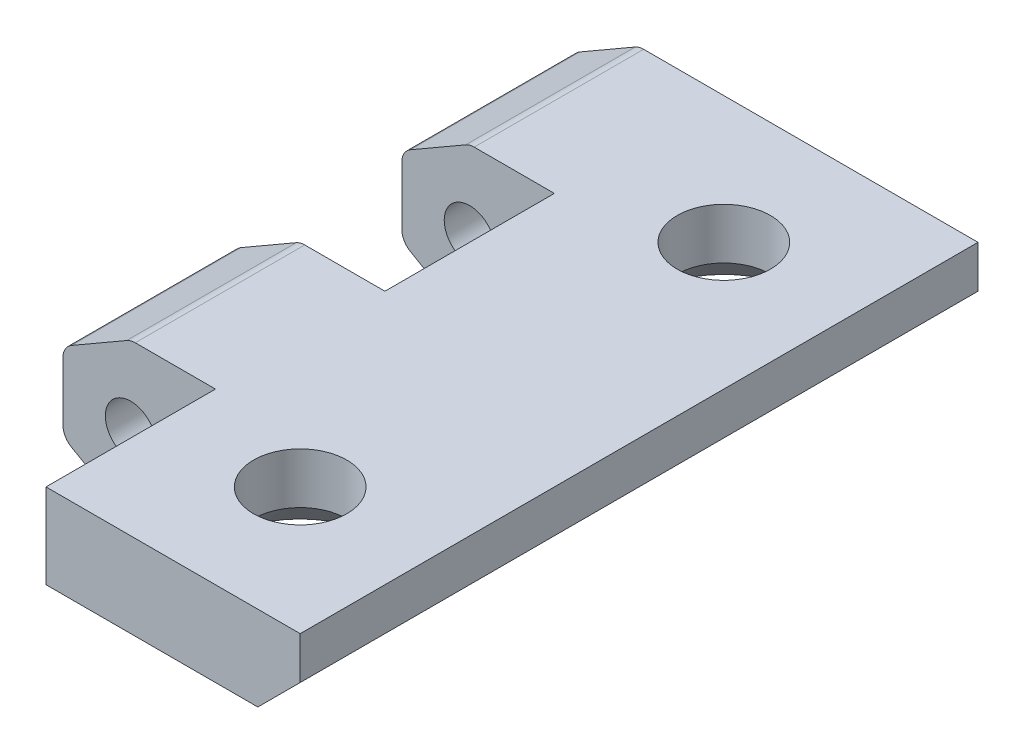
ISO-10303-21;
HEADER;
FILE_DESCRIPTION(('STEP AP214'),'2;1');
FILE_NAME('part.step','',(''),(''),'','','');
FILE_SCHEMA(('AUTOMOTIVE_DESIGN { 1 0 10303 214 1 1 1 1 }'));
ENDSEC;
DATA;
#1=APPLICATION_CONTEXT('core data for automotive mechanical design processes');
#2=APPLICATION_PROTOCOL_DEFINITION('international standard','automotive_design',2000,#1);
#3=PRODUCT_CONTEXT('',#1,'mechanical');
#4=PRODUCT('Part','Part','',(#3));
#5=PRODUCT_RELATED_PRODUCT_CATEGORY('part','',(#4));
#6=PRODUCT_DEFINITION_FORMATION('','',#4);
#7=PRODUCT_DEFINITION_CONTEXT('part definition',#1,'design');
#8=PRODUCT_DEFINITION('design','',#6,#7);
#9=PRODUCT_DEFINITION_SHAPE('','',#8);
#10=(LENGTH_UNIT() NAMED_UNIT(*) SI_UNIT(.MILLI.,.METRE.));
#11=(NAMED_UNIT(*) PLANE_ANGLE_UNIT() SI_UNIT($,.RADIAN.));
#12=(NAMED_UNIT(*) SI_UNIT($,.STERADIAN.) SOLID_ANGLE_UNIT());
#13=UNCERTAINTY_MEASURE_WITH_UNIT(LENGTH_MEASURE(1.E-05),#10,'distance_accuracy_value','');
#14=(GEOMETRIC_REPRESENTATION_CONTEXT(3) GLOBAL_UNCERTAINTY_ASSIGNED_CONTEXT((#13)) GLOBAL_UNIT_ASSIGNED_CONTEXT((#10,
#11,#12)) REPRESENTATION_CONTEXT('',''));
#15=CARTESIAN_POINT('',(0.,0.,0.));
#16=DIRECTION('',(0.,0.,1.));
#17=DIRECTION('',(1.,0.,0.));
#18=AXIS2_PLACEMENT_3D('',#15,#16,#17);
#19=CARTESIAN_POINT('',(4.,0.,40.));
#20=DIRECTION('',(-1.,0.,0.));
#21=DIRECTION('',(0.,-1.,0.));
#22=AXIS2_PLACEMENT_3D('',#19,#20,#21);
#23=PLANE('',#22);
#24=DIRECTION('',(0.,-1.,0.));
#25=VECTOR('',#24,1.);
#26=CARTESIAN_POINT('',(4.,0.,30.));
#27=LINE('',#26,#25);
#28=CARTESIAN_POINT('',(4.,-0.381197846482994,30.));
#29=VERTEX_POINT('',#28);
#30=CARTESIAN_POINT('',(4.,-1.73205080756888,30.));
#31=VERTEX_POINT('',#30);
#32=EDGE_CURVE('E317',#29,#31,#27,.T.);
#33=ORIENTED_EDGE('',*,*,#32,.T.);
#34=DIRECTION('',(0.,0.,-1.));
#35=VECTOR('',#34,1.);
#36=CARTESIAN_POINT('',(4.,-1.73205080756888,40.));
#37=LINE('',#36,#35);
#38=CARTESIAN_POINT('',(4.,-1.73205080756888,20.));
#39=VERTEX_POINT('',#38);
#40=EDGE_CURVE('E44',#31,#39,#37,.T.);
#41=ORIENTED_EDGE('',*,*,#40,.T.);
#42=DIRECTION('',(0.,1.,0.));
#43=VECTOR('',#42,1.);
#44=CARTESIAN_POINT('',(4.,0.,20.));
#45=LINE('',#44,#43);
#46=CARTESIAN_POINT('',(4.,-0.381197846482994,20.));
#47=VERTEX_POINT('',#46);
#48=EDGE_CURVE('E299',#39,#47,#45,.T.);
#49=ORIENTED_EDGE('',*,*,#48,.T.);
#50=DIRECTION('',(0.,0.,-1.));
#51=VECTOR('',#50,1.);
#52=CARTESIAN_POINT('',(4.,-0.381197846482994,40.));
#53=LINE('',#52,#51);
#54=EDGE_CURVE('E373',#29,#47,#53,.T.);
#55=ORIENTED_EDGE('',*,*,#54,.F.);
#56=EDGE_LOOP('',(#33,#41,#49,#55));
#57=FACE_BOUND('',#56,.T.);
#58=ADVANCED_FACE('F36',(#57),#23,.F.);
#59=CARTESIAN_POINT('',(-2.,3.46410161513776,40.));
#60=DIRECTION('',(0.5,-0.866025403784439,0.));
#61=DIRECTION('',(0.866025403784439,0.5,0.));
#62=AXIS2_PLACEMENT_3D('',#59,#60,#61);
#63=PLANE('',#62);
#64=DIRECTION('',(0.866025403784439,0.5,0.));
#65=VECTOR('',#64,1.);
#66=CARTESIAN_POINT('',(-2.,3.46410161513776,30.));
#67=LINE('',#66,#65);
#68=CARTESIAN_POINT('',(-3.5,2.59807621135332,30.));
#69=VERTEX_POINT('',#68);
#70=CARTESIAN_POINT('',(-0.232050807568877,4.48482755730145,30.));
#71=VERTEX_POINT('',#70);
#72=EDGE_CURVE('E314',#69,#71,#67,.T.);
#73=ORIENTED_EDGE('',*,*,#72,.T.);
#74=DIRECTION('',(0.,0.,-1.));
#75=VECTOR('',#74,1.);
#76=CARTESIAN_POINT('',(-0.232050807568877,4.48482755730145,20.));
#77=LINE('',#76,#75);
#78=CARTESIAN_POINT('',(-0.232050807568877,4.48482755730145,20.));
#79=VERTEX_POINT('',#78);
#80=EDGE_CURVE('E399',#71,#79,#77,.T.);
#81=ORIENTED_EDGE('',*,*,#80,.T.);
#82=DIRECTION('',(-0.866025403784439,-0.5,0.));
#83=VECTOR('',#82,1.);
#84=CARTESIAN_POINT('',(-2.,3.46410161513775,20.));
#85=LINE('',#84,#83);
#86=CARTESIAN_POINT('',(-3.5,2.59807621135332,20.));
#87=VERTEX_POINT('',#86);
#88=EDGE_CURVE('E296',#79,#87,#85,.T.);
#89=ORIENTED_EDGE('',*,*,#88,.T.);
#90=DIRECTION('',(0.,0.,-1.));
#91=VECTOR('',#90,1.);
#92=CARTESIAN_POINT('',(-3.5,2.59807621135332,40.));
#93=LINE('',#92,#91);
#94=EDGE_CURVE('E391',#87,#69,#93,.F.);
#95=ORIENTED_EDGE('',*,*,#94,.T.);
#96=EDGE_LOOP('',(#73,#81,#89,#95));
#97=FACE_BOUND('',#96,.T.);
#98=ADVANCED_FACE('F561',(#97),#63,.F.);
#99=CARTESIAN_POINT('',(-4.,0.,40.));
#100=DIRECTION('',(1.,0.,0.));
#101=DIRECTION('',(0.,0.,-1.));
#102=AXIS2_PLACEMENT_3D('',#99,#100,#101);
#103=PLANE('',#102);
#104=DIRECTION('',(0.,1.,0.));
#105=VECTOR('',#104,1.);
#106=CARTESIAN_POINT('',(-4.,0.,30.));
#107=LINE('',#106,#105);
#108=CARTESIAN_POINT('',(-4.,-1.73205080756888,30.));
#109=VERTEX_POINT('',#108);
#110=CARTESIAN_POINT('',(-4.,1.73205080756888,30.));
#111=VERTEX_POINT('',#110);
#112=EDGE_CURVE('E311',#109,#111,#107,.T.);
#113=ORIENTED_EDGE('',*,*,#112,.T.);
#114=DIRECTION('',(0.,0.,-1.));
#115=VECTOR('',#114,1.);
#116=CARTESIAN_POINT('',(-4.,1.73205080756888,40.));
#117=LINE('',#116,#115);
#118=CARTESIAN_POINT('',(-4.,1.73205080756888,20.));
#119=VERTEX_POINT('',#118);
#120=EDGE_CURVE('E450',#111,#119,#117,.T.);
#121=ORIENTED_EDGE('',*,*,#120,.T.);
#122=DIRECTION('',(0.,-1.,0.));
#123=VECTOR('',#122,1.);
#124=CARTESIAN_POINT('',(-4.,0.,20.));
#125=LINE('',#124,#123);
#126=CARTESIAN_POINT('',(-4.,-1.73205080756888,20.));
#127=VERTEX_POINT('',#126);
#128=EDGE_CURVE('E293',#119,#127,#125,.T.);
#129=ORIENTED_EDGE('',*,*,#128,.T.);
#130=DIRECTION('',(0.,0.,-1.));
#131=VECTOR('',#130,1.);
#132=CARTESIAN_POINT('',(-4.,-1.73205080756888,40.));
#133=LINE('',#132,#131);
#134=EDGE_CURVE('E448',#127,#109,#133,.F.);
#135=ORIENTED_EDGE('',*,*,#134,.T.);
#136=EDGE_LOOP('',(#113,#121,#129,#135));
#137=FACE_BOUND('',#136,.T.);
#138=ADVANCED_FACE('F569',(#137),#103,.F.);
#139=CARTESIAN_POINT('',(-2.,-3.46410161513776,40.));
#140=DIRECTION('',(0.5,0.866025403784438,0.));
#141=DIRECTION('',(-0.866025403784439,0.5,0.));
#142=AXIS2_PLACEMENT_3D('',#139,#140,#141);
#143=PLANE('',#142);
#144=DIRECTION('',(-0.866025403784439,0.5,0.));
#145=VECTOR('',#144,1.);
#146=CARTESIAN_POINT('',(-2.,-3.46410161513776,30.));
#147=LINE('',#146,#145);
#148=CARTESIAN_POINT('',(-0.500000000000003,-4.33012701892219,30.));
#149=VERTEX_POINT('',#148);
#150=CARTESIAN_POINT('',(-3.5,-2.59807621135332,30.));
#151=VERTEX_POINT('',#150);
#152=EDGE_CURVE('E308',#149,#151,#147,.T.);
#153=ORIENTED_EDGE('',*,*,#152,.T.);
#154=DIRECTION('',(0.,0.,-1.));
#155=VECTOR('',#154,1.);
#156=CARTESIAN_POINT('',(-3.5,-2.59807621135332,40.));
#157=LINE('',#156,#155);
#158=CARTESIAN_POINT('',(-3.5,-2.59807621135332,20.));
#159=VERTEX_POINT('',#158);
#160=EDGE_CURVE('E465',#151,#159,#157,.T.);
#161=ORIENTED_EDGE('',*,*,#160,.T.);
#162=DIRECTION('',(0.866025403784439,-0.5,0.));
#163=VECTOR('',#162,1.);
#164=CARTESIAN_POINT('',(-2.00000000000001,-3.46410161513775,20.));
#165=LINE('',#164,#163);
#166=CARTESIAN_POINT('',(-0.500000000000003,-4.3301270189222,20.));
#167=VERTEX_POINT('',#166);
#168=EDGE_CURVE('E290',#159,#167,#165,.T.);
#169=ORIENTED_EDGE('',*,*,#168,.T.);
#170=DIRECTION('',(0.,0.,-1.));
#171=VECTOR('',#170,1.);
#172=CARTESIAN_POINT('',(-0.500000000000004,-4.33012701892219,40.));
#173=LINE('',#172,#171);
#174=EDGE_CURVE('E463',#167,#149,#173,.F.);
#175=ORIENTED_EDGE('',*,*,#174,.T.);
#176=EDGE_LOOP('',(#153,#161,#169,#175));
#177=FACE_BOUND('',#176,.T.);
#178=ADVANCED_FACE('F578',(#177),#143,.F.);
#179=CARTESIAN_POINT('',(2.,-3.46410161513776,40.));
#180=DIRECTION('',(-0.5,0.866025403784439,0.));
#181=DIRECTION('',(-0.866025403784439,-0.5,0.));
#182=AXIS2_PLACEMENT_3D('',#179,#180,#181);
#183=PLANE('',#182);
#184=DIRECTION('',(-0.866025403784439,-0.5,0.));
#185=VECTOR('',#184,1.);
#186=CARTESIAN_POINT('',(2.,-3.46410161513776,30.));
#187=LINE('',#186,#185);
#188=CARTESIAN_POINT('',(3.5,-2.59807621135332,30.));
#189=VERTEX_POINT('',#188);
#190=CARTESIAN_POINT('',(0.499999999999997,-4.33012701892219,30.));
#191=VERTEX_POINT('',#190);
#192=EDGE_CURVE('E305',#189,#191,#187,.T.);
#193=ORIENTED_EDGE('',*,*,#192,.T.);
#194=DIRECTION('',(0.,0.,-1.));
#195=VECTOR('',#194,1.);
#196=CARTESIAN_POINT('',(0.499999999999996,-4.3301270189222,40.));
#197=LINE('',#196,#195);
#198=CARTESIAN_POINT('',(0.499999999999997,-4.33012701892219,20.));
#199=VERTEX_POINT('',#198);
#200=EDGE_CURVE('E475',#191,#199,#197,.T.);
#201=ORIENTED_EDGE('',*,*,#200,.T.);
#202=DIRECTION('',(0.866025403784439,0.5,0.));
#203=VECTOR('',#202,1.);
#204=CARTESIAN_POINT('',(1.99999999999999,-3.46410161513776,20.));
#205=LINE('',#204,#203);
#206=CARTESIAN_POINT('',(3.5,-2.59807621135332,20.));
#207=VERTEX_POINT('',#206);
#208=EDGE_CURVE('E287',#199,#207,#205,.T.);
#209=ORIENTED_EDGE('',*,*,#208,.T.);
#210=DIRECTION('',(0.,0.,-1.));
#211=VECTOR('',#210,1.);
#212=CARTESIAN_POINT('',(3.5,-2.59807621135332,40.));
#213=LINE('',#212,#211);
#214=EDGE_CURVE('E473',#207,#189,#213,.F.);
#215=ORIENTED_EDGE('',*,*,#214,.T.);
#216=EDGE_LOOP('',(#193,#201,#209,#215));
#217=FACE_BOUND('',#216,.T.);
#218=ADVANCED_FACE('F586',(#217),#183,.F.);
#219=DIRECTION('',(0.,-1.,0.));
#220=VECTOR('',#219,1.);
#221=CARTESIAN_POINT('',(4.,0.,9.99999999999999));
#222=LINE('',#221,#220);
#223=CARTESIAN_POINT('',(4.,-0.381197846482994,9.99999999999999));
#224=VERTEX_POINT('',#223);
#225=CARTESIAN_POINT('',(4.,-1.73205080756888,9.99999999999999));
#226=VERTEX_POINT('',#225);
#227=EDGE_CURVE('E281',#224,#226,#222,.T.);
#228=ORIENTED_EDGE('',*,*,#227,.T.);
#229=DIRECTION('',(0.,0.,-1.));
#230=VECTOR('',#229,1.);
#231=CARTESIAN_POINT('',(4.,-1.73205080756888,40.));
#232=LINE('',#231,#230);
#233=CARTESIAN_POINT('',(4.,-1.73205080756888,0.));
#234=VERTEX_POINT('',#233);
#235=EDGE_CURVE('E11',#226,#234,#232,.T.);
#236=ORIENTED_EDGE('',*,*,#235,.T.);
#237=DIRECTION('',(0.,1.,0.));
#238=VECTOR('',#237,1.);
#239=CARTESIAN_POINT('',(4.,0.,0.));
#240=LINE('',#239,#238);
#241=CARTESIAN_POINT('',(4.,-0.381197846482994,0.));
#242=VERTEX_POINT('',#241);
#243=EDGE_CURVE('E336',#234,#242,#240,.T.);
#244=ORIENTED_EDGE('',*,*,#243,.T.);
#245=EDGE_CURVE('E370',#224,#242,#53,.T.);
#246=ORIENTED_EDGE('',*,*,#245,.F.);
#247=EDGE_LOOP('',(#228,#236,#244,#246));
#248=FACE_BOUND('',#247,.T.);
#249=ADVANCED_FACE('F549',(#248),#23,.F.);
#250=CARTESIAN_POINT('',(0.,-0.381197846482994,40.));
#251=DIRECTION('',(0.,1.,0.));
#252=DIRECTION('',(0.,0.,1.));
#253=AXIS2_PLACEMENT_3D('',#250,#251,#252);
#254=PLANE('',#253);
#255=CARTESIAN_POINT('',(12.5,-0.381197846482994,7.5));
#256=DIRECTION('',(0.,1.,0.));
#257=DIRECTION('',(0.,0.,1.));
#258=AXIS2_PLACEMENT_3D('',#255,#256,#257);
#259=CIRCLE('',#258,4.75);
#260=CARTESIAN_POINT('',(12.5,-0.381197846482994,12.25));
#261=VERTEX_POINT('',#260);
#262=EDGE_CURVE('E384',#261,#261,#259,.T.);
#263=ORIENTED_EDGE('',*,*,#262,.T.);
#264=EDGE_LOOP('',(#263));
#265=FACE_BOUND('',#264,.T.);
#266=CARTESIAN_POINT('',(12.5,-0.381197846482994,32.5));
#267=DIRECTION('',(0.,1.,0.));
#268=DIRECTION('',(0.,0.,1.));
#269=AXIS2_PLACEMENT_3D('',#266,#267,#268);
#270=CIRCLE('',#269,4.75000000000002);
#271=CARTESIAN_POINT('',(12.5,-0.381197846482994,37.25));
#272=VERTEX_POINT('',#271);
#273=EDGE_CURVE('E381',#272,#272,#270,.T.);
#274=ORIENTED_EDGE('',*,*,#273,.T.);
#275=EDGE_LOOP('',(#274));
#276=FACE_BOUND('',#275,.T.);
#277=DIRECTION('',(1.,0.,0.));
#278=VECTOR('',#277,1.);
#279=CARTESIAN_POINT('',(0.,-0.381197846482994,40.));
#280=LINE('',#279,#278);
#281=CARTESIAN_POINT('',(5.,-0.381197846482994,40.));
#282=VERTEX_POINT('',#281);
#283=CARTESIAN_POINT('',(17.5,-0.381197846482995,40.));
#284=VERTEX_POINT('',#283);
#285=EDGE_CURVE('E325',#282,#284,#280,.T.);
#286=ORIENTED_EDGE('',*,*,#285,.F.);
#287=DIRECTION('',(0.,0.,-1.));
#288=VECTOR('',#287,1.);
#289=CARTESIAN_POINT('',(5.,-0.381197846482994,40.));
#290=LINE('',#289,#288);
#291=CARTESIAN_POINT('',(5.,-0.381197846482994,30.));
#292=VERTEX_POINT('',#291);
#293=EDGE_CURVE('E238',#282,#292,#290,.T.);
#294=ORIENTED_EDGE('',*,*,#293,.T.);
#295=DIRECTION('',(-1.,0.,0.));
#296=VECTOR('',#295,1.);
#297=CARTESIAN_POINT('',(0.,-0.381197846482994,30.));
#298=LINE('',#297,#296);
#299=EDGE_CURVE('E235',#292,#29,#298,.T.);
#300=ORIENTED_EDGE('',*,*,#299,.T.);
#301=ORIENTED_EDGE('',*,*,#54,.T.);
#302=DIRECTION('',(1.,0.,0.));
#303=VECTOR('',#302,1.);
#304=CARTESIAN_POINT('',(0.,-0.381197846482994,20.));
#305=LINE('',#304,#303);
#306=CARTESIAN_POINT('',(5.,-0.381197846482994,20.));
#307=VERTEX_POINT('',#306);
#308=EDGE_CURVE('E301',#47,#307,#305,.T.);
#309=ORIENTED_EDGE('',*,*,#308,.T.);
#310=DIRECTION('',(0.,0.,-1.));
#311=VECTOR('',#310,1.);
#312=CARTESIAN_POINT('',(5.,-0.381197846482994,40.));
#313=LINE('',#312,#311);
#314=CARTESIAN_POINT('',(5.,-0.381197846482994,10.));
#315=VERTEX_POINT('',#314);
#316=EDGE_CURVE('E321',#307,#315,#313,.T.);
#317=ORIENTED_EDGE('',*,*,#316,.T.);
#318=DIRECTION('',(-1.,0.,0.));
#319=VECTOR('',#318,1.);
#320=CARTESIAN_POINT('',(0.,-0.381197846482994,9.99999999999999));
#321=LINE('',#320,#319);
#322=EDGE_CURVE('E283',#315,#224,#321,.T.);
#323=ORIENTED_EDGE('',*,*,#322,.T.);
#324=ORIENTED_EDGE('',*,*,#245,.T.);
#325=DIRECTION('',(1.,0.,0.));
#326=VECTOR('',#325,1.);
#327=CARTESIAN_POINT('',(0.,-0.381197846482994,0.));
#328=LINE('',#327,#326);
#329=CARTESIAN_POINT('',(17.5,-0.381197846482995,0.));
#330=VERTEX_POINT('',#329);
#331=EDGE_CURVE('E338',#242,#330,#328,.T.);
#332=ORIENTED_EDGE('',*,*,#331,.T.);
#333=DIRECTION('',(0.,0.,-1.));
#334=VECTOR('',#333,1.);
#335=CARTESIAN_POINT('',(17.5,-0.381197846482995,40.));
#336=LINE('',#335,#334);
#337=EDGE_CURVE('E367',#284,#330,#336,.T.);
#338=ORIENTED_EDGE('',*,*,#337,.F.);
#339=EDGE_LOOP('',(#286,#294,#300,#301,#309,#317,#323,#324,#332,#338));
#340=FACE_BOUND('',#339,.T.);
#341=ADVANCED_FACE('F493',(#265,#276,#340),#254,.F.);
#342=CARTESIAN_POINT('',(8.9405989232415,-8.9405989232415,40.));
#343=DIRECTION('',(-0.707106781186548,0.707106781186547,0.));
#344=DIRECTION('',(-0.707106781186547,-0.707106781186548,0.));
#345=AXIS2_PLACEMENT_3D('',#342,#343,#344);
#346=PLANE('',#345);
#347=DIRECTION('',(0.707106781186547,0.707106781186548,0.));
#348=VECTOR('',#347,1.);
#349=CARTESIAN_POINT('',(8.9405989232415,-8.9405989232415,0.));
#350=LINE('',#349,#348);
#351=CARTESIAN_POINT('',(20.,2.11880215351701,0.));
#352=VERTEX_POINT('',#351);
#353=EDGE_CURVE('E341',#330,#352,#350,.T.);
#354=ORIENTED_EDGE('',*,*,#353,.T.);
#355=DIRECTION('',(0.,0.,-1.));
#356=VECTOR('',#355,1.);
#357=CARTESIAN_POINT('',(20.,2.11880215351701,40.));
#358=LINE('',#357,#356);
#359=CARTESIAN_POINT('',(20.,2.11880215351701,40.));
#360=VERTEX_POINT('',#359);
#361=EDGE_CURVE('E365',#360,#352,#358,.T.);
#362=ORIENTED_EDGE('',*,*,#361,.F.);
#363=DIRECTION('',(0.707106781186547,0.707106781186548,0.));
#364=VECTOR('',#363,1.);
#365=CARTESIAN_POINT('',(8.9405989232415,-8.9405989232415,40.));
#366=LINE('',#365,#364);
#367=EDGE_CURVE('E327',#284,#360,#366,.T.);
#368=ORIENTED_EDGE('',*,*,#367,.F.);
#369=ORIENTED_EDGE('',*,*,#337,.T.);
#370=EDGE_LOOP('',(#354,#362,#368,#369));
#371=FACE_BOUND('',#370,.T.);
#372=ADVANCED_FACE('F608',(#371),#346,.F.);
#373=CARTESIAN_POINT('',(20.,0.,40.));
#374=DIRECTION('',(1.,0.,0.));
#375=DIRECTION('',(0.,1.,0.));
#376=AXIS2_PLACEMENT_3D('',#373,#374,#375);
#377=PLANE('',#376);
#378=DIRECTION('',(0.,-1.,0.));
#379=VECTOR('',#378,1.);
#380=CARTESIAN_POINT('',(20.,0.,0.));
#381=LINE('',#380,#379);
#382=CARTESIAN_POINT('',(20.,4.61880215351701,0.));
#383=VERTEX_POINT('',#382);
#384=EDGE_CURVE('E344',#383,#352,#381,.T.);
#385=ORIENTED_EDGE('',*,*,#384,.F.);
#386=DIRECTION('',(0.,0.,-1.));
#387=VECTOR('',#386,1.);
#388=CARTESIAN_POINT('',(20.,4.61880215351701,40.));
#389=LINE('',#388,#387);
#390=CARTESIAN_POINT('',(20.,4.61880215351701,40.));
#391=VERTEX_POINT('',#390);
#392=EDGE_CURVE('E335',#391,#383,#389,.T.);
#393=ORIENTED_EDGE('',*,*,#392,.F.);
#394=DIRECTION('',(0.,-1.,0.));
#395=VECTOR('',#394,1.);
#396=CARTESIAN_POINT('',(20.,0.,40.));
#397=LINE('',#396,#395);
#398=EDGE_CURVE('E330',#391,#360,#397,.T.);
#399=ORIENTED_EDGE('',*,*,#398,.T.);
#400=ORIENTED_EDGE('',*,*,#361,.T.);
#401=EDGE_LOOP('',(#385,#393,#399,#400));
#402=FACE_BOUND('',#401,.T.);
#403=ADVANCED_FACE('F502',(#402),#377,.T.);
#404=CARTESIAN_POINT('',(0.,4.61880215351701,40.));
#405=DIRECTION('',(0.,1.,0.));
#406=DIRECTION('',(0.,0.,1.));
#407=AXIS2_PLACEMENT_3D('',#404,#405,#406);
#408=PLANE('',#407);
#409=DIRECTION('',(1.,0.,0.));
#410=VECTOR('',#409,1.);
#411=CARTESIAN_POINT('',(5.,4.61880215351701,20.));
#412=LINE('',#411,#410);
#413=CARTESIAN_POINT('',(0.267949192431122,4.61880215351701,20.));
#414=VERTEX_POINT('',#413);
#415=CARTESIAN_POINT('',(5.,4.61880215351701,20.));
#416=VERTEX_POINT('',#415);
#417=EDGE_CURVE('E262',#414,#416,#412,.T.);
#418=ORIENTED_EDGE('',*,*,#417,.F.);
#419=DIRECTION('',(0.,0.,-1.));
#420=VECTOR('',#419,1.);
#421=CARTESIAN_POINT('',(0.267949192431122,4.61880215351701,30.));
#422=LINE('',#421,#420);
#423=CARTESIAN_POINT('',(0.267949192431122,4.61880215351701,30.));
#424=VERTEX_POINT('',#423);
#425=EDGE_CURVE('E253',#414,#424,#422,.F.);
#426=ORIENTED_EDGE('',*,*,#425,.T.);
#427=DIRECTION('',(-1.,0.,0.));
#428=VECTOR('',#427,1.);
#429=CARTESIAN_POINT('',(5.,4.61880215351701,30.));
#430=LINE('',#429,#428);
#431=CARTESIAN_POINT('',(5.,4.61880215351701,30.));
#432=VERTEX_POINT('',#431);
#433=EDGE_CURVE('E232',#432,#424,#430,.T.);
#434=ORIENTED_EDGE('',*,*,#433,.F.);
#435=DIRECTION('',(0.,0.,-1.));
#436=VECTOR('',#435,1.);
#437=CARTESIAN_POINT('',(5.,4.61880215351701,40.));
#438=LINE('',#437,#436);
#439=CARTESIAN_POINT('',(5.,4.61880215351701,40.));
#440=VERTEX_POINT('',#439);
#441=EDGE_CURVE('E241',#440,#432,#438,.T.);
#442=ORIENTED_EDGE('',*,*,#441,.F.);
#443=DIRECTION('',(1.,0.,0.));
#444=VECTOR('',#443,1.);
#445=CARTESIAN_POINT('',(0.,4.61880215351701,40.));
#446=LINE('',#445,#444);
#447=EDGE_CURVE('E333',#440,#391,#446,.T.);
#448=ORIENTED_EDGE('',*,*,#447,.T.);
#449=ORIENTED_EDGE('',*,*,#392,.T.);
#450=DIRECTION('',(1.,0.,0.));
#451=VECTOR('',#450,1.);
#452=CARTESIAN_POINT('',(0.,4.61880215351701,0.));
#453=LINE('',#452,#451);
#454=CARTESIAN_POINT('',(0.267949192431122,4.61880215351701,0.));
#455=VERTEX_POINT('',#454);
#456=EDGE_CURVE('E347',#455,#383,#453,.T.);
#457=ORIENTED_EDGE('',*,*,#456,.F.);
#458=DIRECTION('',(0.,0.,-1.));
#459=VECTOR('',#458,1.);
#460=CARTESIAN_POINT('',(0.267949192431122,4.61880215351701,9.99999999999999));
#461=LINE('',#460,#459);
#462=CARTESIAN_POINT('',(0.267949192431122,4.61880215351701,10.));
#463=VERTEX_POINT('',#462);
#464=EDGE_CURVE('E412',#455,#463,#461,.F.);
#465=ORIENTED_EDGE('',*,*,#464,.T.);
#466=DIRECTION('',(-1.,0.,0.));
#467=VECTOR('',#466,1.);
#468=CARTESIAN_POINT('',(5.,4.61880215351701,10.));
#469=LINE('',#468,#467);
#470=CARTESIAN_POINT('',(5.,4.61880215351701,10.));
#471=VERTEX_POINT('',#470);
#472=EDGE_CURVE('E259',#471,#463,#469,.T.);
#473=ORIENTED_EDGE('',*,*,#472,.F.);
#474=DIRECTION('',(0.,0.,-1.));
#475=VECTOR('',#474,1.);
#476=CARTESIAN_POINT('',(5.,4.61880215351701,20.));
#477=LINE('',#476,#475);
#478=EDGE_CURVE('E256',#416,#471,#477,.T.);
#479=ORIENTED_EDGE('',*,*,#478,.F.);
#480=EDGE_LOOP('',(#418,#426,#434,#442,#448,#449,#457,#465,#473,#479));
#481=FACE_BOUND('',#480,.T.);
#482=CARTESIAN_POINT('',(12.5,4.61880215351701,32.5));
#483=DIRECTION('',(0.,1.,0.));
#484=DIRECTION('',(0.,0.,1.));
#485=AXIS2_PLACEMENT_3D('',#482,#483,#484);
#486=CIRCLE('',#485,2.75);
#487=CARTESIAN_POINT('',(12.5,4.61880215351701,35.25));
#488=VERTEX_POINT('',#487);
#489=EDGE_CURVE('E339',#488,#488,#486,.T.);
#490=ORIENTED_EDGE('',*,*,#489,.F.);
#491=EDGE_LOOP('',(#490));
#492=FACE_BOUND('',#491,.T.);
#493=CARTESIAN_POINT('',(12.5,4.61880215351701,7.5));
#494=DIRECTION('',(0.,1.,0.));
#495=DIRECTION('',(0.,0.,1.));
#496=AXIS2_PLACEMENT_3D('',#493,#494,#495);
#497=CIRCLE('',#496,2.75);
#498=CARTESIAN_POINT('',(12.5,4.61880215351701,10.25));
#499=VERTEX_POINT('',#498);
#500=EDGE_CURVE('E324',#499,#499,#497,.T.);
#501=ORIENTED_EDGE('',*,*,#500,.F.);
#502=EDGE_LOOP('',(#501));
#503=FACE_BOUND('',#502,.T.);
#504=ADVANCED_FACE('F250',(#481,#492,#503),#408,.T.);
#505=DIRECTION('',(0.866025403784439,0.5,0.));
#506=VECTOR('',#505,1.);
#507=CARTESIAN_POINT('',(-2.,3.46410161513775,9.99999999999999));
#508=LINE('',#507,#506);
#509=CARTESIAN_POINT('',(-3.5,2.59807621135332,9.99999999999999));
#510=VERTEX_POINT('',#509);
#511=CARTESIAN_POINT('',(-0.232050807568877,4.48482755730145,9.99999999999999));
#512=VERTEX_POINT('',#511);
#513=EDGE_CURVE('E278',#510,#512,#508,.T.);
#514=ORIENTED_EDGE('',*,*,#513,.T.);
#515=DIRECTION('',(0.,0.,-1.));
#516=VECTOR('',#515,1.);
#517=CARTESIAN_POINT('',(-0.232050807568877,4.48482755730145,0.));
#518=LINE('',#517,#516);
#519=CARTESIAN_POINT('',(-0.232050807568877,4.48482755730145,0.));
#520=VERTEX_POINT('',#519);
#521=EDGE_CURVE('E427',#512,#520,#518,.T.);
#522=ORIENTED_EDGE('',*,*,#521,.T.);
#523=DIRECTION('',(-0.866025403784439,-0.5,0.));
#524=VECTOR('',#523,1.);
#525=CARTESIAN_POINT('',(-2.,3.46410161513776,0.));
#526=LINE('',#525,#524);
#527=CARTESIAN_POINT('',(-3.5,2.59807621135332,0.));
#528=VERTEX_POINT('',#527);
#529=EDGE_CURVE('E349',#520,#528,#526,.T.);
#530=ORIENTED_EDGE('',*,*,#529,.T.);
#531=DIRECTION('',(0.,0.,-1.));
#532=VECTOR('',#531,1.);
#533=CARTESIAN_POINT('',(-3.5,2.59807621135332,40.));
#534=LINE('',#533,#532);
#535=EDGE_CURVE('E425',#528,#510,#534,.F.);
#536=ORIENTED_EDGE('',*,*,#535,.T.);
#537=EDGE_LOOP('',(#514,#522,#530,#536));
#538=FACE_BOUND('',#537,.T.);
#539=ADVANCED_FACE('F520',(#538),#63,.F.);
#540=DIRECTION('',(0.,1.,0.));
#541=VECTOR('',#540,1.);
#542=CARTESIAN_POINT('',(-4.,0.,9.99999999999999));
#543=LINE('',#542,#541);
#544=CARTESIAN_POINT('',(-4.,-1.73205080756888,9.99999999999999));
#545=VERTEX_POINT('',#544);
#546=CARTESIAN_POINT('',(-4.,1.73205080756888,9.99999999999999));
#547=VERTEX_POINT('',#546);
#548=EDGE_CURVE('E275',#545,#547,#543,.T.);
#549=ORIENTED_EDGE('',*,*,#548,.T.);
#550=DIRECTION('',(0.,0.,-1.));
#551=VECTOR('',#550,1.);
#552=CARTESIAN_POINT('',(-4.,1.73205080756888,40.));
#553=LINE('',#552,#551);
#554=CARTESIAN_POINT('',(-4.,1.73205080756888,0.));
#555=VERTEX_POINT('',#554);
#556=EDGE_CURVE('E455',#547,#555,#553,.T.);
#557=ORIENTED_EDGE('',*,*,#556,.T.);
#558=DIRECTION('',(0.,-1.,0.));
#559=VECTOR('',#558,1.);
#560=CARTESIAN_POINT('',(-4.,0.,0.));
#561=LINE('',#560,#559);
#562=CARTESIAN_POINT('',(-4.,-1.73205080756888,0.));
#563=VERTEX_POINT('',#562);
#564=EDGE_CURVE('E352',#555,#563,#561,.T.);
#565=ORIENTED_EDGE('',*,*,#564,.T.);
#566=DIRECTION('',(0.,0.,-1.));
#567=VECTOR('',#566,1.);
#568=CARTESIAN_POINT('',(-4.,-1.73205080756888,40.));
#569=LINE('',#568,#567);
#570=EDGE_CURVE('E453',#563,#545,#569,.F.);
#571=ORIENTED_EDGE('',*,*,#570,.T.);
#572=EDGE_LOOP('',(#549,#557,#565,#571));
#573=FACE_BOUND('',#572,.T.);
#574=ADVANCED_FACE('F528',(#573),#103,.F.);
#575=DIRECTION('',(-0.866025403784439,0.5,0.));
#576=VECTOR('',#575,1.);
#577=CARTESIAN_POINT('',(-2.,-3.46410161513775,9.99999999999999));
#578=LINE('',#577,#576);
#579=CARTESIAN_POINT('',(-0.500000000000003,-4.33012701892219,9.99999999999999));
#580=VERTEX_POINT('',#579);
#581=CARTESIAN_POINT('',(-3.5,-2.59807621135332,9.99999999999999));
#582=VERTEX_POINT('',#581);
#583=EDGE_CURVE('E272',#580,#582,#578,.T.);
#584=ORIENTED_EDGE('',*,*,#583,.T.);
#585=DIRECTION('',(0.,0.,-1.));
#586=VECTOR('',#585,1.);
#587=CARTESIAN_POINT('',(-3.5,-2.59807621135332,40.));
#588=LINE('',#587,#586);
#589=CARTESIAN_POINT('',(-3.5,-2.59807621135332,0.));
#590=VERTEX_POINT('',#589);
#591=EDGE_CURVE('E460',#582,#590,#588,.T.);
#592=ORIENTED_EDGE('',*,*,#591,.T.);
#593=DIRECTION('',(0.866025403784439,-0.5,0.));
#594=VECTOR('',#593,1.);
#595=CARTESIAN_POINT('',(-2.,-3.46410161513776,0.));
#596=LINE('',#595,#594);
#597=CARTESIAN_POINT('',(-0.500000000000003,-4.33012701892219,0.));
#598=VERTEX_POINT('',#597);
#599=EDGE_CURVE('E355',#590,#598,#596,.T.);
#600=ORIENTED_EDGE('',*,*,#599,.T.);
#601=DIRECTION('',(0.,0.,-1.));
#602=VECTOR('',#601,1.);
#603=CARTESIAN_POINT('',(-0.500000000000004,-4.33012701892219,40.));
#604=LINE('',#603,#602);
#605=EDGE_CURVE('E458',#598,#580,#604,.F.);
#606=ORIENTED_EDGE('',*,*,#605,.T.);
#607=EDGE_LOOP('',(#584,#592,#600,#606));
#608=FACE_BOUND('',#607,.T.);
#609=ADVANCED_FACE('F535',(#608),#143,.F.);
#610=DIRECTION('',(-0.866025403784439,-0.5,0.));
#611=VECTOR('',#610,1.);
#612=CARTESIAN_POINT('',(2.,-3.46410161513776,9.99999999999999));
#613=LINE('',#612,#611);
#614=CARTESIAN_POINT('',(3.5,-2.59807621135332,9.99999999999999));
#615=VERTEX_POINT('',#614);
#616=CARTESIAN_POINT('',(0.499999999999997,-4.33012701892219,9.99999999999999));
#617=VERTEX_POINT('',#616);
#618=EDGE_CURVE('E270',#615,#617,#613,.T.);
#619=ORIENTED_EDGE('',*,*,#618,.T.);
#620=DIRECTION('',(0.,0.,-1.));
#621=VECTOR('',#620,1.);
#622=CARTESIAN_POINT('',(0.499999999999996,-4.3301270189222,40.));
#623=LINE('',#622,#621);
#624=CARTESIAN_POINT('',(0.499999999999997,-4.33012701892219,0.));
#625=VERTEX_POINT('',#624);
#626=EDGE_CURVE('E470',#617,#625,#623,.T.);
#627=ORIENTED_EDGE('',*,*,#626,.T.);
#628=DIRECTION('',(0.866025403784439,0.5,0.));
#629=VECTOR('',#628,1.);
#630=CARTESIAN_POINT('',(2.,-3.46410161513776,0.));
#631=LINE('',#630,#629);
#632=CARTESIAN_POINT('',(3.5,-2.59807621135332,0.));
#633=VERTEX_POINT('',#632);
#634=EDGE_CURVE('E358',#625,#633,#631,.T.);
#635=ORIENTED_EDGE('',*,*,#634,.T.);
#636=DIRECTION('',(0.,0.,-1.));
#637=VECTOR('',#636,1.);
#638=CARTESIAN_POINT('',(3.5,-2.59807621135332,40.));
#639=LINE('',#638,#637);
#640=EDGE_CURVE('E468',#633,#615,#639,.F.);
#641=ORIENTED_EDGE('',*,*,#640,.T.);
#642=EDGE_LOOP('',(#619,#627,#635,#641));
#643=FACE_BOUND('',#642,.T.);
#644=ADVANCED_FACE('F543',(#643),#183,.F.);
#645=CARTESIAN_POINT('',(0.,0.,40.));
#646=DIRECTION('',(0.,0.,-1.));
#647=DIRECTION('',(-1.,0.,0.));
#648=AXIS2_PLACEMENT_3D('',#645,#646,#647);
#649=CYLINDRICAL_SURFACE('',#648,1.5);
#650=CARTESIAN_POINT('',(0.,0.,9.99999999999999));
#651=DIRECTION('',(0.,0.,-1.));
#652=DIRECTION('',(-1.,0.,0.));
#653=AXIS2_PLACEMENT_3D('',#650,#651,#652);
#654=CIRCLE('',#653,1.5);
#655=CARTESIAN_POINT('',(-1.5,0.,9.99999999999999));
#656=VERTEX_POINT('',#655);
#657=EDGE_CURVE('E269',#656,#656,#654,.T.);
#658=ORIENTED_EDGE('',*,*,#657,.F.);
#659=EDGE_LOOP('',(#658));
#660=FACE_BOUND('',#659,.T.);
#661=CARTESIAN_POINT('',(0.,0.,0.));
#662=DIRECTION('',(0.,0.,1.));
#663=DIRECTION('',(1.,0.,0.));
#664=AXIS2_PLACEMENT_3D('',#661,#662,#663);
#665=CIRCLE('',#664,1.5);
#666=CARTESIAN_POINT('',(1.5,0.,0.));
#667=VERTEX_POINT('',#666);
#668=EDGE_CURVE('E328',#667,#667,#665,.T.);
#669=ORIENTED_EDGE('',*,*,#668,.F.);
#670=EDGE_LOOP('',(#669));
#671=FACE_BOUND('',#670,.T.);
#672=ADVANCED_FACE('F617',(#660,#671),#649,.F.);
#673=CARTESIAN_POINT('',(0.,0.,40.));
#674=DIRECTION('',(0.,0.,1.));
#675=DIRECTION('',(1.,0.,0.));
#676=AXIS2_PLACEMENT_3D('',#673,#674,#675);
#677=PLANE('',#676);
#678=DIRECTION('',(0.,1.,0.));
#679=VECTOR('',#678,1.);
#680=CARTESIAN_POINT('',(5.,0.,40.));
#681=LINE('',#680,#679);
#682=EDGE_CURVE('E244',#282,#440,#681,.T.);
#683=ORIENTED_EDGE('',*,*,#682,.F.);
#684=ORIENTED_EDGE('',*,*,#285,.T.);
#685=ORIENTED_EDGE('',*,*,#367,.T.);
#686=ORIENTED_EDGE('',*,*,#398,.F.);
#687=ORIENTED_EDGE('',*,*,#447,.F.);
#688=EDGE_LOOP('',(#683,#684,#685,#686,#687));
#689=FACE_BOUND('',#688,.T.);
#690=ADVANCED_FACE('F496',(#689),#677,.T.);
#691=CARTESIAN_POINT('',(0.,0.,0.));
#692=DIRECTION('',(0.,0.,1.));
#693=DIRECTION('',(1.,0.,0.));
#694=AXIS2_PLACEMENT_3D('',#691,#692,#693);
#695=PLANE('',#694);
#696=ORIENTED_EDGE('',*,*,#529,.F.);
#697=CARTESIAN_POINT('',(0.267949192431122,3.61880215351701,0.));
#698=DIRECTION('',(0.,0.,1.));
#699=DIRECTION('',(1.,0.,0.));
#700=AXIS2_PLACEMENT_3D('',#697,#698,#699);
#701=CIRCLE('',#700,1.);
#702=EDGE_CURVE('E438',#520,#455,#701,.F.);
#703=ORIENTED_EDGE('',*,*,#702,.T.);
#704=ORIENTED_EDGE('',*,*,#456,.T.);
#705=ORIENTED_EDGE('',*,*,#384,.T.);
#706=ORIENTED_EDGE('',*,*,#353,.F.);
#707=ORIENTED_EDGE('',*,*,#331,.F.);
#708=ORIENTED_EDGE('',*,*,#243,.F.);
#709=CARTESIAN_POINT('',(3.,-1.73205080756888,0.));
#710=DIRECTION('',(0.,0.,1.));
#711=DIRECTION('',(1.,0.,0.));
#712=AXIS2_PLACEMENT_3D('',#709,#710,#711);
#713=CIRCLE('',#712,1.);
#714=EDGE_CURVE('E430',#234,#633,#713,.F.);
#715=ORIENTED_EDGE('',*,*,#714,.T.);
#716=ORIENTED_EDGE('',*,*,#634,.F.);
#717=CARTESIAN_POINT('',(0.,-3.46410161513776,0.));
#718=DIRECTION('',(0.,0.,1.));
#719=DIRECTION('',(1.,0.,0.));
#720=AXIS2_PLACEMENT_3D('',#717,#718,#719);
#721=CIRCLE('',#720,1.);
#722=EDGE_CURVE('E432',#625,#598,#721,.F.);
#723=ORIENTED_EDGE('',*,*,#722,.T.);
#724=ORIENTED_EDGE('',*,*,#599,.F.);
#725=CARTESIAN_POINT('',(-3.,-1.73205080756888,0.));
#726=DIRECTION('',(0.,0.,1.));
#727=DIRECTION('',(1.,0.,0.));
#728=AXIS2_PLACEMENT_3D('',#725,#726,#727);
#729=CIRCLE('',#728,1.);
#730=EDGE_CURVE('E434',#590,#563,#729,.F.);
#731=ORIENTED_EDGE('',*,*,#730,.T.);
#732=ORIENTED_EDGE('',*,*,#564,.F.);
#733=CARTESIAN_POINT('',(-3.,1.73205080756888,0.));
#734=DIRECTION('',(0.,0.,1.));
#735=DIRECTION('',(1.,0.,0.));
#736=AXIS2_PLACEMENT_3D('',#733,#734,#735);
#737=CIRCLE('',#736,1.);
#738=EDGE_CURVE('E436',#555,#528,#737,.F.);
#739=ORIENTED_EDGE('',*,*,#738,.T.);
#740=EDGE_LOOP('',(#696,#703,#704,#705,#706,#707,#708,#715,#716,#723,#724,#731,#732,#739));
#741=FACE_BOUND('',#740,.T.);
#742=ORIENTED_EDGE('',*,*,#668,.T.);
#743=EDGE_LOOP('',(#742));
#744=FACE_BOUND('',#743,.T.);
#745=ADVANCED_FACE('F507',(#741,#744),#695,.F.);
#746=CARTESIAN_POINT('',(12.5,9.61880215351701,7.5));
#747=DIRECTION('',(0.,-1.,0.));
#748=DIRECTION('',(0.,0.,-1.));
#749=AXIS2_PLACEMENT_3D('',#746,#747,#748);
#750=CYLINDRICAL_SURFACE('',#749,2.75);
#751=CARTESIAN_POINT('',(12.5,1.61880215351701,7.5));
#752=DIRECTION('',(0.,1.,0.));
#753=DIRECTION('',(0.,0.,1.));
#754=AXIS2_PLACEMENT_3D('',#751,#752,#753);
#755=CIRCLE('',#754,2.75);
#756=CARTESIAN_POINT('',(12.5,1.61880215351701,10.25));
#757=VERTEX_POINT('',#756);
#758=EDGE_CURVE('E378',#757,#757,#755,.F.);
#759=ORIENTED_EDGE('',*,*,#758,.T.);
#760=EDGE_LOOP('',(#759));
#761=FACE_BOUND('',#760,.T.);
#762=ORIENTED_EDGE('',*,*,#500,.T.);
#763=EDGE_LOOP('',(#762));
#764=FACE_BOUND('',#763,.T.);
#765=ADVANCED_FACE('F676',(#761,#764),#750,.F.);
#766=CARTESIAN_POINT('',(12.5,9.61880215351701,32.5));
#767=DIRECTION('',(0.,-1.,0.));
#768=DIRECTION('',(0.,0.,-1.));
#769=AXIS2_PLACEMENT_3D('',#766,#767,#768);
#770=CYLINDRICAL_SURFACE('',#769,2.75);
#771=CARTESIAN_POINT('',(12.5,1.61880215351701,32.5));
#772=DIRECTION('',(0.,1.,0.));
#773=DIRECTION('',(0.,0.,1.));
#774=AXIS2_PLACEMENT_3D('',#771,#772,#773);
#775=CIRCLE('',#774,2.75);
#776=CARTESIAN_POINT('',(12.5,1.61880215351701,35.25));
#777=VERTEX_POINT('',#776);
#778=EDGE_CURVE('E387',#777,#777,#775,.F.);
#779=ORIENTED_EDGE('',*,*,#778,.T.);
#780=EDGE_LOOP('',(#779));
#781=FACE_BOUND('',#780,.T.);
#782=ORIENTED_EDGE('',*,*,#489,.T.);
#783=EDGE_LOOP('',(#782));
#784=FACE_BOUND('',#783,.T.);
#785=ADVANCED_FACE('F795',(#781,#784),#770,.F.);
#786=CARTESIAN_POINT('',(12.5,1.61880215351701,7.5));
#787=DIRECTION('',(0.,-1.,0.));
#788=DIRECTION('',(0.,0.,-1.));
#789=AXIS2_PLACEMENT_3D('',#786,#787,#788);
#790=CONICAL_SURFACE('',#789,2.75,0.785398163397449);
#791=ORIENTED_EDGE('',*,*,#262,.F.);
#792=EDGE_LOOP('',(#791));
#793=FACE_BOUND('',#792,.T.);
#794=ORIENTED_EDGE('',*,*,#758,.F.);
#795=EDGE_LOOP('',(#794));
#796=FACE_BOUND('',#795,.T.);
#797=ADVANCED_FACE('F792',(#793,#796),#790,.F.);
#798=CARTESIAN_POINT('',(12.5,1.61880215351701,32.5));
#799=DIRECTION('',(0.,-1.,0.));
#800=DIRECTION('',(0.,0.,-1.));
#801=AXIS2_PLACEMENT_3D('',#798,#799,#800);
#802=CONICAL_SURFACE('',#801,2.75,0.785398163397451);
#803=ORIENTED_EDGE('',*,*,#273,.F.);
#804=EDGE_LOOP('',(#803));
#805=FACE_BOUND('',#804,.T.);
#806=ORIENTED_EDGE('',*,*,#778,.F.);
#807=EDGE_LOOP('',(#806));
#808=FACE_BOUND('',#807,.T.);
#809=ADVANCED_FACE('F689',(#805,#808),#802,.F.);
#810=CARTESIAN_POINT('',(5.,-5.38119784648299,30.));
#811=DIRECTION('',(0.,0.,-1.));
#812=DIRECTION('',(-1.,0.,0.));
#813=AXIS2_PLACEMENT_3D('',#810,#811,#812);
#814=PLANE('',#813);
#815=CARTESIAN_POINT('',(0.,0.,30.));
#816=DIRECTION('',(0.,0.,-1.));
#817=DIRECTION('',(-1.,0.,0.));
#818=AXIS2_PLACEMENT_3D('',#815,#816,#817);
#819=CIRCLE('',#818,1.5);
#820=CARTESIAN_POINT('',(-1.5,0.,30.));
#821=VERTEX_POINT('',#820);
#822=EDGE_CURVE('E304',#821,#821,#819,.T.);
#823=ORIENTED_EDGE('',*,*,#822,.T.);
#824=EDGE_LOOP('',(#823));
#825=FACE_BOUND('',#824,.T.);
#826=ORIENTED_EDGE('',*,*,#433,.T.);
#827=CARTESIAN_POINT('',(0.267949192431122,3.61880215351701,30.));
#828=DIRECTION('',(0.,0.,-1.));
#829=DIRECTION('',(-1.,0.,0.));
#830=AXIS2_PLACEMENT_3D('',#827,#828,#829);
#831=CIRCLE('',#830,1.);
#832=EDGE_CURVE('E423',#424,#71,#831,.F.);
#833=ORIENTED_EDGE('',*,*,#832,.T.);
#834=ORIENTED_EDGE('',*,*,#72,.F.);
#835=CARTESIAN_POINT('',(-3.,1.73205080756888,30.));
#836=DIRECTION('',(0.,0.,-1.));
#837=DIRECTION('',(-1.,0.,0.));
#838=AXIS2_PLACEMENT_3D('',#835,#836,#837);
#839=CIRCLE('',#838,1.);
#840=EDGE_CURVE('E421',#69,#111,#839,.F.);
#841=ORIENTED_EDGE('',*,*,#840,.T.);
#842=ORIENTED_EDGE('',*,*,#112,.F.);
#843=CARTESIAN_POINT('',(-3.,-1.73205080756888,30.));
#844=DIRECTION('',(0.,0.,-1.));
#845=DIRECTION('',(-1.,0.,0.));
#846=AXIS2_PLACEMENT_3D('',#843,#844,#845);
#847=CIRCLE('',#846,1.);
#848=EDGE_CURVE('E419',#109,#151,#847,.F.);
#849=ORIENTED_EDGE('',*,*,#848,.T.);
#850=ORIENTED_EDGE('',*,*,#152,.F.);
#851=CARTESIAN_POINT('',(0.,-3.46410161513776,30.));
#852=DIRECTION('',(0.,0.,-1.));
#853=DIRECTION('',(-1.,0.,0.));
#854=AXIS2_PLACEMENT_3D('',#851,#852,#853);
#855=CIRCLE('',#854,1.);
#856=EDGE_CURVE('E417',#149,#191,#855,.F.);
#857=ORIENTED_EDGE('',*,*,#856,.T.);
#858=ORIENTED_EDGE('',*,*,#192,.F.);
#859=CARTESIAN_POINT('',(3.,-1.73205080756888,30.));
#860=DIRECTION('',(0.,0.,-1.));
#861=DIRECTION('',(-1.,0.,0.));
#862=AXIS2_PLACEMENT_3D('',#859,#860,#861);
#863=CIRCLE('',#862,1.);
#864=EDGE_CURVE('E415',#189,#31,#863,.F.);
#865=ORIENTED_EDGE('',*,*,#864,.T.);
#866=ORIENTED_EDGE('',*,*,#32,.F.);
#867=ORIENTED_EDGE('',*,*,#299,.F.);
#868=DIRECTION('',(0.,1.,0.));
#869=VECTOR('',#868,1.);
#870=CARTESIAN_POINT('',(5.,-5.38119784648299,30.));
#871=LINE('',#870,#869);
#872=EDGE_CURVE('E228',#292,#432,#871,.T.);
#873=ORIENTED_EDGE('',*,*,#872,.T.);
#874=EDGE_LOOP('',(#826,#833,#834,#841,#842,#849,#850,#857,#858,#865,#866,#867,#873));
#875=FACE_BOUND('',#874,.T.);
#876=ADVANCED_FACE('F230',(#825,#875),#814,.F.);
#877=CARTESIAN_POINT('',(5.,-5.38119784648299,40.));
#878=DIRECTION('',(1.,0.,0.));
#879=DIRECTION('',(0.,0.,-1.));
#880=AXIS2_PLACEMENT_3D('',#877,#878,#879);
#881=PLANE('',#880);
#882=ORIENTED_EDGE('',*,*,#682,.T.);
#883=ORIENTED_EDGE('',*,*,#441,.T.);
#884=ORIENTED_EDGE('',*,*,#872,.F.);
#885=ORIENTED_EDGE('',*,*,#293,.F.);
#886=EDGE_LOOP('',(#882,#883,#884,#885));
#887=FACE_BOUND('',#886,.T.);
#888=ADVANCED_FACE('F242',(#887),#881,.F.);
#889=CARTESIAN_POINT('',(5.,-5.38119784648299,20.));
#890=DIRECTION('',(1.,0.,0.));
#891=DIRECTION('',(0.,0.,-1.));
#892=AXIS2_PLACEMENT_3D('',#889,#890,#891);
#893=PLANE('',#892);
#894=DIRECTION('',(0.,1.,0.));
#895=VECTOR('',#894,1.);
#896=CARTESIAN_POINT('',(5.,-5.38119784648299,20.));
#897=LINE('',#896,#895);
#898=EDGE_CURVE('E247',#307,#416,#897,.T.);
#899=ORIENTED_EDGE('',*,*,#898,.T.);
#900=ORIENTED_EDGE('',*,*,#478,.T.);
#901=DIRECTION('',(0.,1.,0.));
#902=VECTOR('',#901,1.);
#903=CARTESIAN_POINT('',(5.,-5.38119784648299,10.));
#904=LINE('',#903,#902);
#905=EDGE_CURVE('E264',#315,#471,#904,.T.);
#906=ORIENTED_EDGE('',*,*,#905,.F.);
#907=ORIENTED_EDGE('',*,*,#316,.F.);
#908=EDGE_LOOP('',(#899,#900,#906,#907));
#909=FACE_BOUND('',#908,.T.);
#910=ADVANCED_FACE('F553',(#909),#893,.F.);
#911=CARTESIAN_POINT('',(5.,-5.38119784648299,20.));
#912=DIRECTION('',(0.,0.,1.));
#913=DIRECTION('',(1.,0.,0.));
#914=AXIS2_PLACEMENT_3D('',#911,#912,#913);
#915=PLANE('',#914);
#916=CARTESIAN_POINT('',(0.,0.,20.));
#917=DIRECTION('',(0.,0.,1.));
#918=DIRECTION('',(1.,0.,0.));
#919=AXIS2_PLACEMENT_3D('',#916,#917,#918);
#920=CIRCLE('',#919,1.5);
#921=CARTESIAN_POINT('',(1.5,0.,20.));
#922=VERTEX_POINT('',#921);
#923=EDGE_CURVE('E286',#922,#922,#920,.T.);
#924=ORIENTED_EDGE('',*,*,#923,.T.);
#925=EDGE_LOOP('',(#924));
#926=FACE_BOUND('',#925,.T.);
#927=ORIENTED_EDGE('',*,*,#88,.F.);
#928=CARTESIAN_POINT('',(0.267949192431122,3.61880215351701,20.));
#929=DIRECTION('',(0.,0.,1.));
#930=DIRECTION('',(1.,0.,0.));
#931=AXIS2_PLACEMENT_3D('',#928,#929,#930);
#932=CIRCLE('',#931,1.);
#933=EDGE_CURVE('E410',#79,#414,#932,.F.);
#934=ORIENTED_EDGE('',*,*,#933,.T.);
#935=ORIENTED_EDGE('',*,*,#417,.T.);
#936=ORIENTED_EDGE('',*,*,#898,.F.);
#937=ORIENTED_EDGE('',*,*,#308,.F.);
#938=ORIENTED_EDGE('',*,*,#48,.F.);
#939=CARTESIAN_POINT('',(3.,-1.73205080756888,20.));
#940=DIRECTION('',(0.,0.,1.));
#941=DIRECTION('',(1.,0.,0.));
#942=AXIS2_PLACEMENT_3D('',#939,#940,#941);
#943=CIRCLE('',#942,1.);
#944=EDGE_CURVE('E402',#39,#207,#943,.F.);
#945=ORIENTED_EDGE('',*,*,#944,.T.);
#946=ORIENTED_EDGE('',*,*,#208,.F.);
#947=CARTESIAN_POINT('',(0.,-3.46410161513776,20.));
#948=DIRECTION('',(0.,0.,1.));
#949=DIRECTION('',(1.,0.,0.));
#950=AXIS2_PLACEMENT_3D('',#947,#948,#949);
#951=CIRCLE('',#950,1.);
#952=EDGE_CURVE('E404',#199,#167,#951,.F.);
#953=ORIENTED_EDGE('',*,*,#952,.T.);
#954=ORIENTED_EDGE('',*,*,#168,.F.);
#955=CARTESIAN_POINT('',(-3.,-1.73205080756888,20.));
#956=DIRECTION('',(0.,0.,1.));
#957=DIRECTION('',(1.,0.,0.));
#958=AXIS2_PLACEMENT_3D('',#955,#956,#957);
#959=CIRCLE('',#958,1.);
#960=EDGE_CURVE('E406',#159,#127,#959,.F.);
#961=ORIENTED_EDGE('',*,*,#960,.T.);
#962=ORIENTED_EDGE('',*,*,#128,.F.);
#963=CARTESIAN_POINT('',(-3.,1.73205080756888,20.));
#964=DIRECTION('',(0.,0.,1.));
#965=DIRECTION('',(1.,0.,0.));
#966=AXIS2_PLACEMENT_3D('',#963,#964,#965);
#967=CIRCLE('',#966,1.);
#968=EDGE_CURVE('E408',#119,#87,#967,.F.);
#969=ORIENTED_EDGE('',*,*,#968,.T.);
#970=EDGE_LOOP('',(#927,#934,#935,#936,#937,#938,#945,#946,#953,#954,#961,#962,#969));
#971=FACE_BOUND('',#970,.T.);
#972=ADVANCED_FACE('F487',(#926,#971),#915,.F.);
#973=CARTESIAN_POINT('',(5.,-5.38119784648299,10.));
#974=DIRECTION('',(0.,0.,-1.));
#975=DIRECTION('',(-1.,0.,0.));
#976=AXIS2_PLACEMENT_3D('',#973,#974,#975);
#977=PLANE('',#976);
#978=ORIENTED_EDGE('',*,*,#657,.T.);
#979=EDGE_LOOP('',(#978));
#980=FACE_BOUND('',#979,.T.);
#981=ORIENTED_EDGE('',*,*,#472,.T.);
#982=CARTESIAN_POINT('',(0.267949192431122,3.61880215351701,9.99999999999999));
#983=DIRECTION('',(0.,0.,-1.));
#984=DIRECTION('',(-1.,0.,0.));
#985=AXIS2_PLACEMENT_3D('',#982,#983,#984);
#986=CIRCLE('',#985,1.);
#987=EDGE_CURVE('E446',#463,#512,#986,.F.);
#988=ORIENTED_EDGE('',*,*,#987,.T.);
#989=ORIENTED_EDGE('',*,*,#513,.F.);
#990=CARTESIAN_POINT('',(-3.,1.73205080756888,9.99999999999999));
#991=DIRECTION('',(0.,0.,-1.));
#992=DIRECTION('',(-1.,0.,0.));
#993=AXIS2_PLACEMENT_3D('',#990,#991,#992);
#994=CIRCLE('',#993,1.);
#995=EDGE_CURVE('E444',#510,#547,#994,.F.);
#996=ORIENTED_EDGE('',*,*,#995,.T.);
#997=ORIENTED_EDGE('',*,*,#548,.F.);
#998=CARTESIAN_POINT('',(-3.,-1.73205080756888,9.99999999999999));
#999=DIRECTION('',(0.,0.,-1.));
#1000=DIRECTION('',(-1.,0.,0.));
#1001=AXIS2_PLACEMENT_3D('',#998,#999,#1000);
#1002=CIRCLE('',#1001,1.);
#1003=EDGE_CURVE('E442',#545,#582,#1002,.F.);
#1004=ORIENTED_EDGE('',*,*,#1003,.T.);
#1005=ORIENTED_EDGE('',*,*,#583,.F.);
#1006=CARTESIAN_POINT('',(0.,-3.46410161513776,9.99999999999999));
#1007=DIRECTION('',(0.,0.,-1.));
#1008=DIRECTION('',(-1.,0.,0.));
#1009=AXIS2_PLACEMENT_3D('',#1006,#1007,#1008);
#1010=CIRCLE('',#1009,1.);
#1011=EDGE_CURVE('E57',#580,#617,#1010,.F.);
#1012=ORIENTED_EDGE('',*,*,#1011,.T.);
#1013=ORIENTED_EDGE('',*,*,#618,.F.);
#1014=CARTESIAN_POINT('',(3.,-1.73205080756888,9.99999999999999));
#1015=DIRECTION('',(0.,0.,-1.));
#1016=DIRECTION('',(-1.,0.,0.));
#1017=AXIS2_PLACEMENT_3D('',#1014,#1015,#1016);
#1018=CIRCLE('',#1017,1.);
#1019=EDGE_CURVE('E51',#615,#226,#1018,.F.);
#1020=ORIENTED_EDGE('',*,*,#1019,.T.);
#1021=ORIENTED_EDGE('',*,*,#227,.F.);
#1022=ORIENTED_EDGE('',*,*,#322,.F.);
#1023=ORIENTED_EDGE('',*,*,#905,.T.);
#1024=EDGE_LOOP('',(#981,#988,#989,#996,#997,#1004,#1005,#1012,#1013,#1020,#1021,#1022,#1023));
#1025=FACE_BOUND('',#1024,.T.);
#1026=ADVANCED_FACE('F517',(#980,#1025),#977,.F.);
#1027=ORIENTED_EDGE('',*,*,#822,.F.);
#1028=EDGE_LOOP('',(#1027));
#1029=FACE_BOUND('',#1028,.T.);
#1030=ORIENTED_EDGE('',*,*,#923,.F.);
#1031=EDGE_LOOP('',(#1030));
#1032=FACE_BOUND('',#1031,.T.);
#1033=ADVANCED_FACE('F623',(#1029,#1032),#649,.F.);
#1034=CARTESIAN_POINT('',(0.267949192431122,3.61880215351701,40.));
#1035=DIRECTION('',(0.,0.,1.));
#1036=DIRECTION('',(1.,0.,0.));
#1037=AXIS2_PLACEMENT_3D('',#1034,#1035,#1036);
#1038=CYLINDRICAL_SURFACE('',#1037,1.);
#1039=ORIENTED_EDGE('',*,*,#832,.F.);
#1040=ORIENTED_EDGE('',*,*,#425,.F.);
#1041=ORIENTED_EDGE('',*,*,#933,.F.);
#1042=ORIENTED_EDGE('',*,*,#80,.F.);
#1043=EDGE_LOOP('',(#1039,#1040,#1041,#1042));
#1044=FACE_BOUND('',#1043,.T.);
#1045=ADVANCED_FACE('F556',(#1044),#1038,.T.);
#1046=CARTESIAN_POINT('',(0.267949192431122,3.61880215351701,40.));
#1047=DIRECTION('',(0.,0.,1.));
#1048=DIRECTION('',(1.,0.,0.));
#1049=AXIS2_PLACEMENT_3D('',#1046,#1047,#1048);
#1050=CYLINDRICAL_SURFACE('',#1049,1.);
#1051=ORIENTED_EDGE('',*,*,#987,.F.);
#1052=ORIENTED_EDGE('',*,*,#464,.F.);
#1053=ORIENTED_EDGE('',*,*,#702,.F.);
#1054=ORIENTED_EDGE('',*,*,#521,.F.);
#1055=EDGE_LOOP('',(#1051,#1052,#1053,#1054));
#1056=FACE_BOUND('',#1055,.T.);
#1057=ADVANCED_FACE('F514',(#1056),#1050,.T.);
#1058=CARTESIAN_POINT('',(-3.,1.73205080756888,40.));
#1059=DIRECTION('',(0.,0.,-1.));
#1060=DIRECTION('',(-1.,0.,0.));
#1061=AXIS2_PLACEMENT_3D('',#1058,#1059,#1060);
#1062=CYLINDRICAL_SURFACE('',#1061,1.);
#1063=ORIENTED_EDGE('',*,*,#840,.F.);
#1064=ORIENTED_EDGE('',*,*,#94,.F.);
#1065=ORIENTED_EDGE('',*,*,#968,.F.);
#1066=ORIENTED_EDGE('',*,*,#120,.F.);
#1067=EDGE_LOOP('',(#1063,#1064,#1065,#1066));
#1068=FACE_BOUND('',#1067,.T.);
#1069=ADVANCED_FACE('F564',(#1068),#1062,.T.);
#1070=CARTESIAN_POINT('',(-3.,1.73205080756888,40.));
#1071=DIRECTION('',(0.,0.,-1.));
#1072=DIRECTION('',(-1.,0.,0.));
#1073=AXIS2_PLACEMENT_3D('',#1070,#1071,#1072);
#1074=CYLINDRICAL_SURFACE('',#1073,1.);
#1075=ORIENTED_EDGE('',*,*,#995,.F.);
#1076=ORIENTED_EDGE('',*,*,#535,.F.);
#1077=ORIENTED_EDGE('',*,*,#738,.F.);
#1078=ORIENTED_EDGE('',*,*,#556,.F.);
#1079=EDGE_LOOP('',(#1075,#1076,#1077,#1078));
#1080=FACE_BOUND('',#1079,.T.);
#1081=ADVANCED_FACE('F523',(#1080),#1074,.T.);
#1082=CARTESIAN_POINT('',(-3.,-1.73205080756888,40.));
#1083=DIRECTION('',(0.,0.,-1.));
#1084=DIRECTION('',(-1.,0.,0.));
#1085=AXIS2_PLACEMENT_3D('',#1082,#1083,#1084);
#1086=CYLINDRICAL_SURFACE('',#1085,1.);
#1087=ORIENTED_EDGE('',*,*,#1003,.F.);
#1088=ORIENTED_EDGE('',*,*,#570,.F.);
#1089=ORIENTED_EDGE('',*,*,#730,.F.);
#1090=ORIENTED_EDGE('',*,*,#591,.F.);
#1091=EDGE_LOOP('',(#1087,#1088,#1089,#1090));
#1092=FACE_BOUND('',#1091,.T.);
#1093=ADVANCED_FACE('F532',(#1092),#1086,.T.);
#1094=CARTESIAN_POINT('',(-3.,-1.73205080756888,40.));
#1095=DIRECTION('',(0.,0.,-1.));
#1096=DIRECTION('',(-1.,0.,0.));
#1097=AXIS2_PLACEMENT_3D('',#1094,#1095,#1096);
#1098=CYLINDRICAL_SURFACE('',#1097,1.);
#1099=ORIENTED_EDGE('',*,*,#848,.F.);
#1100=ORIENTED_EDGE('',*,*,#134,.F.);
#1101=ORIENTED_EDGE('',*,*,#960,.F.);
#1102=ORIENTED_EDGE('',*,*,#160,.F.);
#1103=EDGE_LOOP('',(#1099,#1100,#1101,#1102));
#1104=FACE_BOUND('',#1103,.T.);
#1105=ADVANCED_FACE('F573',(#1104),#1098,.T.);
#1106=CARTESIAN_POINT('',(0.,-3.46410161513776,40.));
#1107=DIRECTION('',(0.,0.,-1.));
#1108=DIRECTION('',(-1.,0.,0.));
#1109=AXIS2_PLACEMENT_3D('',#1106,#1107,#1108);
#1110=CYLINDRICAL_SURFACE('',#1109,1.);
#1111=ORIENTED_EDGE('',*,*,#1011,.F.);
#1112=ORIENTED_EDGE('',*,*,#605,.F.);
#1113=ORIENTED_EDGE('',*,*,#722,.F.);
#1114=ORIENTED_EDGE('',*,*,#626,.F.);
#1115=EDGE_LOOP('',(#1111,#1112,#1113,#1114));
#1116=FACE_BOUND('',#1115,.T.);
#1117=ADVANCED_FACE('F539',(#1116),#1110,.T.);
#1118=CARTESIAN_POINT('',(0.,-3.46410161513776,40.));
#1119=DIRECTION('',(0.,0.,-1.));
#1120=DIRECTION('',(-1.,0.,0.));
#1121=AXIS2_PLACEMENT_3D('',#1118,#1119,#1120);
#1122=CYLINDRICAL_SURFACE('',#1121,1.);
#1123=ORIENTED_EDGE('',*,*,#856,.F.);
#1124=ORIENTED_EDGE('',*,*,#174,.F.);
#1125=ORIENTED_EDGE('',*,*,#952,.F.);
#1126=ORIENTED_EDGE('',*,*,#200,.F.);
#1127=EDGE_LOOP('',(#1123,#1124,#1125,#1126));
#1128=FACE_BOUND('',#1127,.T.);
#1129=ADVANCED_FACE('F582',(#1128),#1122,.T.);
#1130=CARTESIAN_POINT('',(3.,-1.73205080756888,40.));
#1131=DIRECTION('',(0.,0.,-1.));
#1132=DIRECTION('',(-1.,0.,0.));
#1133=AXIS2_PLACEMENT_3D('',#1130,#1131,#1132);
#1134=CYLINDRICAL_SURFACE('',#1133,1.);
#1135=ORIENTED_EDGE('',*,*,#864,.F.);
#1136=ORIENTED_EDGE('',*,*,#214,.F.);
#1137=ORIENTED_EDGE('',*,*,#944,.F.);
#1138=ORIENTED_EDGE('',*,*,#40,.F.);
#1139=EDGE_LOOP('',(#1135,#1136,#1137,#1138));
#1140=FACE_BOUND('',#1139,.T.);
#1141=ADVANCED_FACE('F588',(#1140),#1134,.T.);
#1142=CARTESIAN_POINT('',(3.,-1.73205080756888,40.));
#1143=DIRECTION('',(0.,0.,-1.));
#1144=DIRECTION('',(-1.,0.,0.));
#1145=AXIS2_PLACEMENT_3D('',#1142,#1143,#1144);
#1146=CYLINDRICAL_SURFACE('',#1145,1.);
#1147=ORIENTED_EDGE('',*,*,#1019,.F.);
#1148=ORIENTED_EDGE('',*,*,#640,.F.);
#1149=ORIENTED_EDGE('',*,*,#714,.F.);
#1150=ORIENTED_EDGE('',*,*,#235,.F.);
#1151=EDGE_LOOP('',(#1147,#1148,#1149,#1150));
#1152=FACE_BOUND('',#1151,.T.);
#1153=ADVANCED_FACE('F38',(#1152),#1146,.T.);
#1154=CLOSED_SHELL('',(#58,#98,#138,#178,#218,#249,#341,#372,#403,#504,#539,#574,#609,#644,#672,
#690,#745,#765,#785,#797,#809,#876,#888,#910,#972,#1026,#1033,#1045,#1057,#1069,#1081,#1093,
#1105,#1117,#1129,#1141,#1153));
#1155=MANIFOLD_SOLID_BREP('B2',#1154);
#1156=ADVANCED_BREP_SHAPE_REPRESENTATION('',(#18,#1155),#14);
#1157=SHAPE_DEFINITION_REPRESENTATION(#9,#1156);
ENDSEC;
END-ISO-10303-21;
